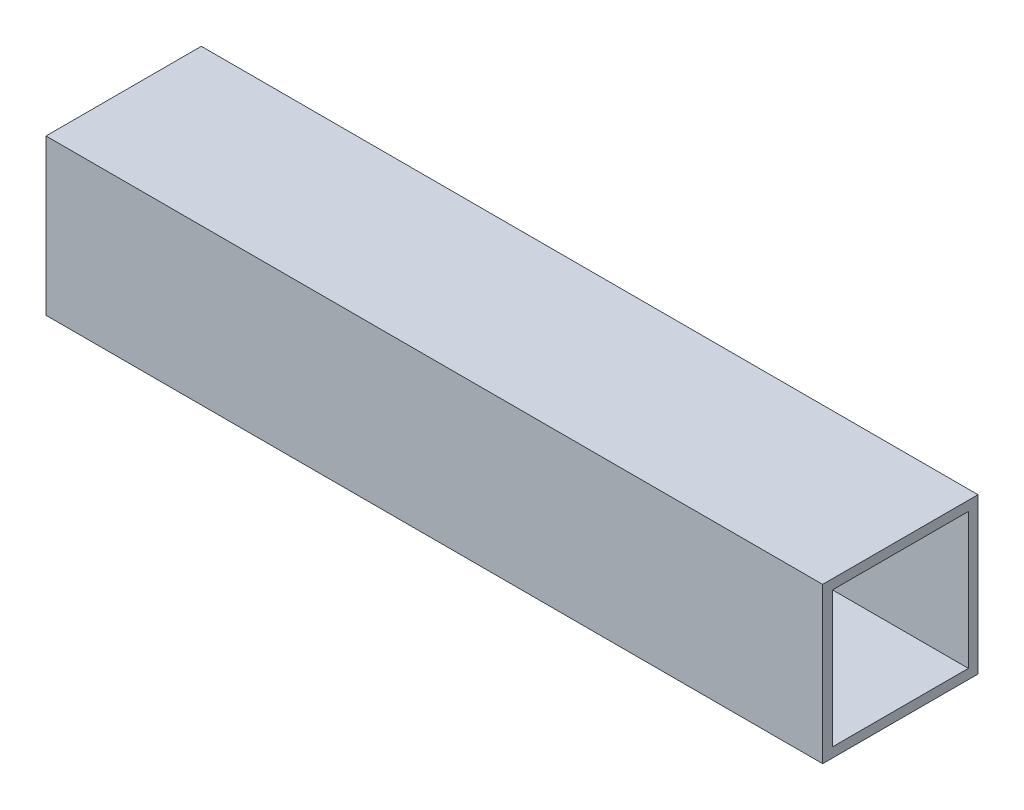
ISO-10303-21;
HEADER;
FILE_DESCRIPTION(('STEP AP214'),'2;1');
FILE_NAME('part.step','',(''),(''),'','','');
FILE_SCHEMA(('AUTOMOTIVE_DESIGN { 1 0 10303 214 1 1 1 1 }'));
ENDSEC;
DATA;
#1=APPLICATION_CONTEXT('core data for automotive mechanical design processes');
#2=APPLICATION_PROTOCOL_DEFINITION('international standard','automotive_design',2000,#1);
#3=PRODUCT_CONTEXT('',#1,'mechanical');
#4=PRODUCT('Part','Part','',(#3));
#5=PRODUCT_RELATED_PRODUCT_CATEGORY('part','',(#4));
#6=PRODUCT_DEFINITION_FORMATION('','',#4);
#7=PRODUCT_DEFINITION_CONTEXT('part definition',#1,'design');
#8=PRODUCT_DEFINITION('design','',#6,#7);
#9=PRODUCT_DEFINITION_SHAPE('','',#8);
#10=(LENGTH_UNIT() NAMED_UNIT(*) SI_UNIT(.MILLI.,.METRE.));
#11=(NAMED_UNIT(*) PLANE_ANGLE_UNIT() SI_UNIT($,.RADIAN.));
#12=(NAMED_UNIT(*) SI_UNIT($,.STERADIAN.) SOLID_ANGLE_UNIT());
#13=UNCERTAINTY_MEASURE_WITH_UNIT(LENGTH_MEASURE(1.E-05),#10,'distance_accuracy_value','');
#14=(GEOMETRIC_REPRESENTATION_CONTEXT(3) GLOBAL_UNCERTAINTY_ASSIGNED_CONTEXT((#13)) GLOBAL_UNIT_ASSIGNED_CONTEXT((#10,
#11,#12)) REPRESENTATION_CONTEXT('',''));
#15=CARTESIAN_POINT('',(0.,0.,0.));
#16=DIRECTION('',(0.,0.,1.));
#17=DIRECTION('',(1.,0.,0.));
#18=AXIS2_PLACEMENT_3D('',#15,#16,#17);
#19=CARTESIAN_POINT('',(254.,0.,0.));
#20=DIRECTION('',(-1.,0.,0.));
#21=DIRECTION('',(0.,0.,1.));
#22=AXIS2_PLACEMENT_3D('',#19,#20,#21);
#23=PLANE('',#22);
#24=DIRECTION('',(0.,-1.,0.));
#25=VECTOR('',#24,1.);
#26=CARTESIAN_POINT('',(254.,0.,0.));
#27=LINE('',#26,#25);
#28=CARTESIAN_POINT('',(254.,50.8,0.));
#29=VERTEX_POINT('',#28);
#30=CARTESIAN_POINT('',(254.,0.,0.));
#31=VERTEX_POINT('',#30);
#32=EDGE_CURVE('E133',#29,#31,#27,.T.);
#33=ORIENTED_EDGE('',*,*,#32,.T.);
#34=DIRECTION('',(0.,0.,-1.));
#35=VECTOR('',#34,1.);
#36=CARTESIAN_POINT('',(254.,0.,0.));
#37=LINE('',#36,#35);
#38=CARTESIAN_POINT('',(254.,0.,-50.8));
#39=VERTEX_POINT('',#38);
#40=EDGE_CURVE('E136',#31,#39,#37,.T.);
#41=ORIENTED_EDGE('',*,*,#40,.T.);
#42=DIRECTION('',(0.,1.,0.));
#43=VECTOR('',#42,1.);
#44=CARTESIAN_POINT('',(254.,0.,-50.8));
#45=LINE('',#44,#43);
#46=CARTESIAN_POINT('',(254.,50.8,-50.8));
#47=VERTEX_POINT('',#46);
#48=EDGE_CURVE('E139',#39,#47,#45,.T.);
#49=ORIENTED_EDGE('',*,*,#48,.T.);
#50=DIRECTION('',(0.,0.,1.));
#51=VECTOR('',#50,1.);
#52=CARTESIAN_POINT('',(254.,50.8,0.));
#53=LINE('',#52,#51);
#54=EDGE_CURVE('E141',#47,#29,#53,.T.);
#55=ORIENTED_EDGE('',*,*,#54,.T.);
#56=EDGE_LOOP('',(#33,#41,#49,#55));
#57=FACE_BOUND('',#56,.T.);
#58=DIRECTION('',(0.,-1.,0.));
#59=VECTOR('',#58,1.);
#60=CARTESIAN_POINT('',(254.,47.625,-3.175));
#61=LINE('',#60,#59);
#62=CARTESIAN_POINT('',(254.,47.625,-3.175));
#63=VERTEX_POINT('',#62);
#64=CARTESIAN_POINT('',(254.,3.175,-3.175));
#65=VERTEX_POINT('',#64);
#66=EDGE_CURVE('E97',#63,#65,#61,.T.);
#67=ORIENTED_EDGE('',*,*,#66,.F.);
#68=DIRECTION('',(0.,0.,1.));
#69=VECTOR('',#68,1.);
#70=CARTESIAN_POINT('',(254.,47.625,-3.175));
#71=LINE('',#70,#69);
#72=CARTESIAN_POINT('',(254.,47.625,-47.6631));
#73=VERTEX_POINT('',#72);
#74=EDGE_CURVE('E119',#73,#63,#71,.T.);
#75=ORIENTED_EDGE('',*,*,#74,.F.);
#76=DIRECTION('',(0.,1.,0.));
#77=VECTOR('',#76,1.);
#78=CARTESIAN_POINT('',(254.,47.625,-47.6631));
#79=LINE('',#78,#77);
#80=CARTESIAN_POINT('',(254.,3.175,-47.6631));
#81=VERTEX_POINT('',#80);
#82=EDGE_CURVE('E117',#81,#73,#79,.T.);
#83=ORIENTED_EDGE('',*,*,#82,.F.);
#84=DIRECTION('',(0.,0.,-1.));
#85=VECTOR('',#84,1.);
#86=CARTESIAN_POINT('',(254.,3.175,-3.175));
#87=LINE('',#86,#85);
#88=EDGE_CURVE('E105',#65,#81,#87,.T.);
#89=ORIENTED_EDGE('',*,*,#88,.F.);
#90=EDGE_LOOP('',(#67,#75,#83,#89));
#91=FACE_BOUND('',#90,.T.);
#92=ADVANCED_FACE('F32',(#57,#91),#23,.F.);
#93=CARTESIAN_POINT('',(0.,0.,0.));
#94=DIRECTION('',(-1.,0.,0.));
#95=DIRECTION('',(0.,0.,1.));
#96=AXIS2_PLACEMENT_3D('',#93,#94,#95);
#97=PLANE('',#96);
#98=DIRECTION('',(0.,-1.,0.));
#99=VECTOR('',#98,1.);
#100=CARTESIAN_POINT('',(0.,0.,0.));
#101=LINE('',#100,#99);
#102=CARTESIAN_POINT('',(0.,50.8,0.));
#103=VERTEX_POINT('',#102);
#104=CARTESIAN_POINT('',(0.,0.,0.));
#105=VERTEX_POINT('',#104);
#106=EDGE_CURVE('E113',#103,#105,#101,.T.);
#107=ORIENTED_EDGE('',*,*,#106,.F.);
#108=DIRECTION('',(0.,0.,1.));
#109=VECTOR('',#108,1.);
#110=CARTESIAN_POINT('',(0.,50.8,0.));
#111=LINE('',#110,#109);
#112=CARTESIAN_POINT('',(0.,50.8,-50.8));
#113=VERTEX_POINT('',#112);
#114=EDGE_CURVE('E137',#113,#103,#111,.T.);
#115=ORIENTED_EDGE('',*,*,#114,.F.);
#116=DIRECTION('',(0.,1.,0.));
#117=VECTOR('',#116,1.);
#118=CARTESIAN_POINT('',(0.,0.,-50.8));
#119=LINE('',#118,#117);
#120=CARTESIAN_POINT('',(0.,0.,-50.8));
#121=VERTEX_POINT('',#120);
#122=EDGE_CURVE('E148',#121,#113,#119,.T.);
#123=ORIENTED_EDGE('',*,*,#122,.F.);
#124=DIRECTION('',(0.,0.,-1.));
#125=VECTOR('',#124,1.);
#126=CARTESIAN_POINT('',(0.,0.,0.));
#127=LINE('',#126,#125);
#128=EDGE_CURVE('E146',#105,#121,#127,.T.);
#129=ORIENTED_EDGE('',*,*,#128,.F.);
#130=EDGE_LOOP('',(#107,#115,#123,#129));
#131=FACE_BOUND('',#130,.T.);
#132=DIRECTION('',(0.,0.,1.));
#133=VECTOR('',#132,1.);
#134=CARTESIAN_POINT('',(0.,47.625,-3.175));
#135=LINE('',#134,#133);
#136=CARTESIAN_POINT('',(0.,47.625,-47.6631));
#137=VERTEX_POINT('',#136);
#138=CARTESIAN_POINT('',(0.,47.625,-3.175));
#139=VERTEX_POINT('',#138);
#140=EDGE_CURVE('E106',#137,#139,#135,.T.);
#141=ORIENTED_EDGE('',*,*,#140,.T.);
#142=DIRECTION('',(0.,-1.,0.));
#143=VECTOR('',#142,1.);
#144=CARTESIAN_POINT('',(0.,47.625,-3.175));
#145=LINE('',#144,#143);
#146=CARTESIAN_POINT('',(0.,3.175,-3.175));
#147=VERTEX_POINT('',#146);
#148=EDGE_CURVE('E55',#139,#147,#145,.T.);
#149=ORIENTED_EDGE('',*,*,#148,.T.);
#150=DIRECTION('',(0.,0.,-1.));
#151=VECTOR('',#150,1.);
#152=CARTESIAN_POINT('',(0.,3.175,-3.175));
#153=LINE('',#152,#151);
#154=CARTESIAN_POINT('',(0.,3.175,-47.6631));
#155=VERTEX_POINT('',#154);
#156=EDGE_CURVE('E112',#147,#155,#153,.T.);
#157=ORIENTED_EDGE('',*,*,#156,.T.);
#158=DIRECTION('',(0.,1.,0.));
#159=VECTOR('',#158,1.);
#160=CARTESIAN_POINT('',(0.,47.625,-47.6631));
#161=LINE('',#160,#159);
#162=EDGE_CURVE('E125',#155,#137,#161,.T.);
#163=ORIENTED_EDGE('',*,*,#162,.T.);
#164=EDGE_LOOP('',(#141,#149,#157,#163));
#165=FACE_BOUND('',#164,.T.);
#166=ADVANCED_FACE('F166',(#131,#165),#97,.T.);
#167=CARTESIAN_POINT('',(254.,0.,0.));
#168=DIRECTION('',(0.,0.,-1.));
#169=DIRECTION('',(-1.,0.,0.));
#170=AXIS2_PLACEMENT_3D('',#167,#168,#169);
#171=PLANE('',#170);
#172=ORIENTED_EDGE('',*,*,#106,.T.);
#173=DIRECTION('',(-1.,0.,0.));
#174=VECTOR('',#173,1.);
#175=CARTESIAN_POINT('',(254.,0.,0.));
#176=LINE('',#175,#174);
#177=EDGE_CURVE('E11',#31,#105,#176,.T.);
#178=ORIENTED_EDGE('',*,*,#177,.F.);
#179=ORIENTED_EDGE('',*,*,#32,.F.);
#180=DIRECTION('',(-1.,0.,0.));
#181=VECTOR('',#180,1.);
#182=CARTESIAN_POINT('',(254.,50.8,0.));
#183=LINE('',#182,#181);
#184=EDGE_CURVE('E143',#29,#103,#183,.T.);
#185=ORIENTED_EDGE('',*,*,#184,.T.);
#186=EDGE_LOOP('',(#172,#178,#179,#185));
#187=FACE_BOUND('',#186,.T.);
#188=ADVANCED_FACE('F34',(#187),#171,.F.);
#189=CARTESIAN_POINT('',(254.,0.,0.));
#190=DIRECTION('',(0.,1.,0.));
#191=DIRECTION('',(0.,0.,1.));
#192=AXIS2_PLACEMENT_3D('',#189,#190,#191);
#193=PLANE('',#192);
#194=ORIENTED_EDGE('',*,*,#128,.T.);
#195=DIRECTION('',(-1.,0.,0.));
#196=VECTOR('',#195,1.);
#197=CARTESIAN_POINT('',(254.,0.,-50.8));
#198=LINE('',#197,#196);
#199=EDGE_CURVE('E40',#39,#121,#198,.T.);
#200=ORIENTED_EDGE('',*,*,#199,.F.);
#201=ORIENTED_EDGE('',*,*,#40,.F.);
#202=ORIENTED_EDGE('',*,*,#177,.T.);
#203=EDGE_LOOP('',(#194,#200,#201,#202));
#204=FACE_BOUND('',#203,.T.);
#205=ADVANCED_FACE('F176',(#204),#193,.F.);
#206=CARTESIAN_POINT('',(254.,0.,-50.8));
#207=DIRECTION('',(0.,0.,1.));
#208=DIRECTION('',(1.,0.,0.));
#209=AXIS2_PLACEMENT_3D('',#206,#207,#208);
#210=PLANE('',#209);
#211=ORIENTED_EDGE('',*,*,#122,.T.);
#212=DIRECTION('',(-1.,0.,0.));
#213=VECTOR('',#212,1.);
#214=CARTESIAN_POINT('',(254.,50.8,-50.8));
#215=LINE('',#214,#213);
#216=EDGE_CURVE('E153',#47,#113,#215,.T.);
#217=ORIENTED_EDGE('',*,*,#216,.F.);
#218=ORIENTED_EDGE('',*,*,#48,.F.);
#219=ORIENTED_EDGE('',*,*,#199,.T.);
#220=EDGE_LOOP('',(#211,#217,#218,#219));
#221=FACE_BOUND('',#220,.T.);
#222=ADVANCED_FACE('F160',(#221),#210,.F.);
#223=CARTESIAN_POINT('',(254.,50.8,0.));
#224=DIRECTION('',(0.,-1.,0.));
#225=DIRECTION('',(0.,0.,-1.));
#226=AXIS2_PLACEMENT_3D('',#223,#224,#225);
#227=PLANE('',#226);
#228=ORIENTED_EDGE('',*,*,#114,.T.);
#229=ORIENTED_EDGE('',*,*,#184,.F.);
#230=ORIENTED_EDGE('',*,*,#54,.F.);
#231=ORIENTED_EDGE('',*,*,#216,.T.);
#232=EDGE_LOOP('',(#228,#229,#230,#231));
#233=FACE_BOUND('',#232,.T.);
#234=ADVANCED_FACE('F170',(#233),#227,.F.);
#235=CARTESIAN_POINT('',(254.,47.625,-3.175));
#236=DIRECTION('',(0.,0.,-1.));
#237=DIRECTION('',(0.,1.,0.));
#238=AXIS2_PLACEMENT_3D('',#235,#236,#237);
#239=PLANE('',#238);
#240=ORIENTED_EDGE('',*,*,#148,.F.);
#241=DIRECTION('',(-1.,0.,0.));
#242=VECTOR('',#241,1.);
#243=CARTESIAN_POINT('',(254.,47.625,-3.175));
#244=LINE('',#243,#242);
#245=EDGE_CURVE('E101',#63,#139,#244,.T.);
#246=ORIENTED_EDGE('',*,*,#245,.F.);
#247=ORIENTED_EDGE('',*,*,#66,.T.);
#248=DIRECTION('',(-1.,0.,0.));
#249=VECTOR('',#248,1.);
#250=CARTESIAN_POINT('',(254.,3.175,-3.175));
#251=LINE('',#250,#249);
#252=EDGE_CURVE('E100',#65,#147,#251,.T.);
#253=ORIENTED_EDGE('',*,*,#252,.T.);
#254=EDGE_LOOP('',(#240,#246,#247,#253));
#255=FACE_BOUND('',#254,.T.);
#256=ADVANCED_FACE('F99',(#255),#239,.T.);
#257=CARTESIAN_POINT('',(254.,3.175,-3.175));
#258=DIRECTION('',(0.,1.,0.));
#259=DIRECTION('',(0.,0.,1.));
#260=AXIS2_PLACEMENT_3D('',#257,#258,#259);
#261=PLANE('',#260);
#262=ORIENTED_EDGE('',*,*,#156,.F.);
#263=ORIENTED_EDGE('',*,*,#252,.F.);
#264=ORIENTED_EDGE('',*,*,#88,.T.);
#265=DIRECTION('',(-1.,0.,0.));
#266=VECTOR('',#265,1.);
#267=CARTESIAN_POINT('',(254.,3.175,-47.6631));
#268=LINE('',#267,#266);
#269=EDGE_CURVE('E114',#81,#155,#268,.T.);
#270=ORIENTED_EDGE('',*,*,#269,.T.);
#271=EDGE_LOOP('',(#262,#263,#264,#270));
#272=FACE_BOUND('',#271,.T.);
#273=ADVANCED_FACE('F109',(#272),#261,.T.);
#274=CARTESIAN_POINT('',(254.,47.625,-47.6631));
#275=DIRECTION('',(0.,0.,1.));
#276=DIRECTION('',(0.,-1.,0.));
#277=AXIS2_PLACEMENT_3D('',#274,#275,#276);
#278=PLANE('',#277);
#279=ORIENTED_EDGE('',*,*,#162,.F.);
#280=ORIENTED_EDGE('',*,*,#269,.F.);
#281=ORIENTED_EDGE('',*,*,#82,.T.);
#282=DIRECTION('',(-1.,0.,0.));
#283=VECTOR('',#282,1.);
#284=CARTESIAN_POINT('',(254.,47.625,-47.6631));
#285=LINE('',#284,#283);
#286=EDGE_CURVE('E47',#73,#137,#285,.T.);
#287=ORIENTED_EDGE('',*,*,#286,.T.);
#288=EDGE_LOOP('',(#279,#280,#281,#287));
#289=FACE_BOUND('',#288,.T.);
#290=ADVANCED_FACE('F199',(#289),#278,.T.);
#291=CARTESIAN_POINT('',(254.,47.625,-3.175));
#292=DIRECTION('',(0.,-1.,0.));
#293=DIRECTION('',(0.,0.,-1.));
#294=AXIS2_PLACEMENT_3D('',#291,#292,#293);
#295=PLANE('',#294);
#296=ORIENTED_EDGE('',*,*,#140,.F.);
#297=ORIENTED_EDGE('',*,*,#286,.F.);
#298=ORIENTED_EDGE('',*,*,#74,.T.);
#299=ORIENTED_EDGE('',*,*,#245,.T.);
#300=EDGE_LOOP('',(#296,#297,#298,#299));
#301=FACE_BOUND('',#300,.T.);
#302=ADVANCED_FACE('F203',(#301),#295,.T.);
#303=CLOSED_SHELL('',(#92,#166,#188,#205,#222,#234,#256,#273,#290,#302));
#304=MANIFOLD_SOLID_BREP('B2',#303);
#305=ADVANCED_BREP_SHAPE_REPRESENTATION('',(#18,#304),#14);
#306=SHAPE_DEFINITION_REPRESENTATION(#9,#305);
ENDSEC;
END-ISO-10303-21;
